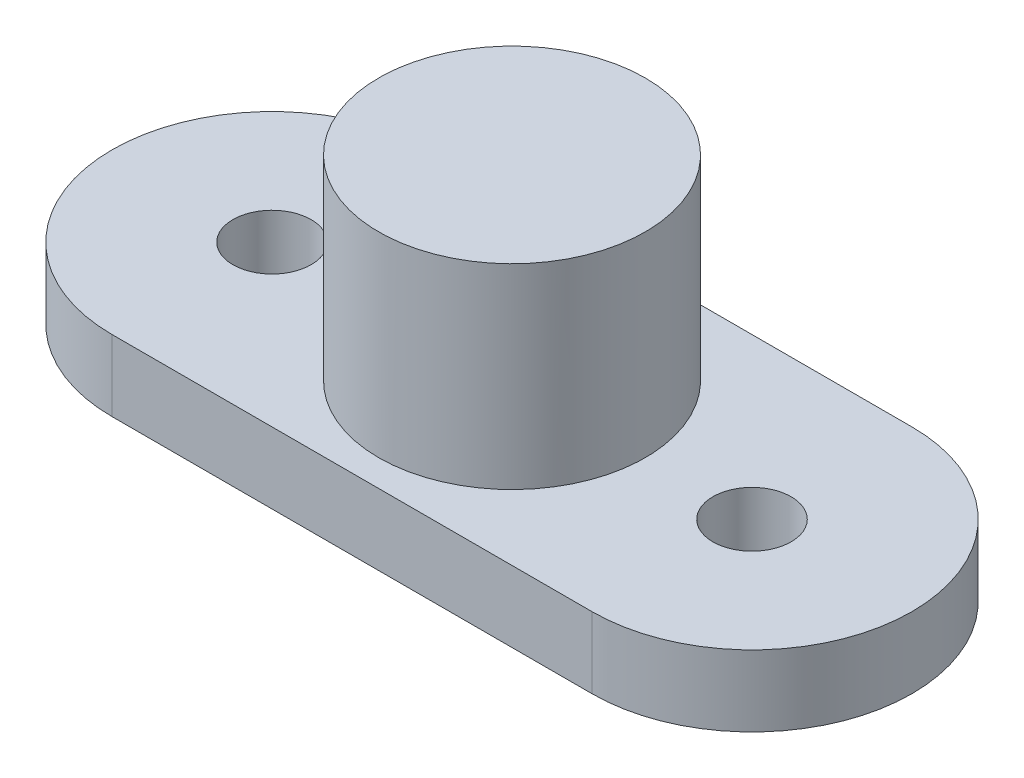
ISO-10303-21;
HEADER;
FILE_DESCRIPTION(('STEP AP214'),'2;1');
FILE_NAME('part.step','',(''),(''),'','','');
FILE_SCHEMA(('AUTOMOTIVE_DESIGN { 1 0 10303 214 1 1 1 1 }'));
ENDSEC;
DATA;
#1=APPLICATION_CONTEXT('core data for automotive mechanical design processes');
#2=APPLICATION_PROTOCOL_DEFINITION('international standard','automotive_design',2000,#1);
#3=PRODUCT_CONTEXT('',#1,'mechanical');
#4=PRODUCT('Part','Part','',(#3));
#5=PRODUCT_RELATED_PRODUCT_CATEGORY('part','',(#4));
#6=PRODUCT_DEFINITION_FORMATION('','',#4);
#7=PRODUCT_DEFINITION_CONTEXT('part definition',#1,'design');
#8=PRODUCT_DEFINITION('design','',#6,#7);
#9=PRODUCT_DEFINITION_SHAPE('','',#8);
#10=(LENGTH_UNIT() NAMED_UNIT(*) SI_UNIT(.MILLI.,.METRE.));
#11=(NAMED_UNIT(*) PLANE_ANGLE_UNIT() SI_UNIT($,.RADIAN.));
#12=(NAMED_UNIT(*) SI_UNIT($,.STERADIAN.) SOLID_ANGLE_UNIT());
#13=UNCERTAINTY_MEASURE_WITH_UNIT(LENGTH_MEASURE(1.E-05),#10,'distance_accuracy_value','');
#14=(GEOMETRIC_REPRESENTATION_CONTEXT(3) GLOBAL_UNCERTAINTY_ASSIGNED_CONTEXT((#13)) GLOBAL_UNIT_ASSIGNED_CONTEXT((#10,
#11,#12)) REPRESENTATION_CONTEXT('',''));
#15=CARTESIAN_POINT('',(0.,0.,0.));
#16=DIRECTION('',(0.,0.,1.));
#17=DIRECTION('',(1.,0.,0.));
#18=AXIS2_PLACEMENT_3D('',#15,#16,#17);
#19=CARTESIAN_POINT('',(0.,2.,-4.49950296687665));
#20=DIRECTION('',(0.,0.,-1.));
#21=DIRECTION('',(-1.,0.,0.));
#22=AXIS2_PLACEMENT_3D('',#19,#20,#21);
#23=PLANE('',#22);
#24=DIRECTION('',(1.,0.,0.));
#25=VECTOR('',#24,1.);
#26=CARTESIAN_POINT('',(0.,0.,-4.49950296687665));
#27=LINE('',#26,#25);
#28=CARTESIAN_POINT('',(-6.75,0.,-4.49950296687665));
#29=VERTEX_POINT('',#28);
#30=CARTESIAN_POINT('',(6.75,0.,-4.49950296687665));
#31=VERTEX_POINT('',#30);
#32=EDGE_CURVE('E119',#29,#31,#27,.T.);
#33=ORIENTED_EDGE('',*,*,#32,.F.);
#34=DIRECTION('',(0.,-1.,0.));
#35=VECTOR('',#34,1.);
#36=CARTESIAN_POINT('',(-6.75,2.,-4.49950296687665));
#37=LINE('',#36,#35);
#38=CARTESIAN_POINT('',(-6.75,2.,-4.49950296687665));
#39=VERTEX_POINT('',#38);
#40=EDGE_CURVE('E11',#39,#29,#37,.T.);
#41=ORIENTED_EDGE('',*,*,#40,.F.);
#42=DIRECTION('',(1.,0.,0.));
#43=VECTOR('',#42,1.);
#44=CARTESIAN_POINT('',(0.,2.,-4.49950296687665));
#45=LINE('',#44,#43);
#46=CARTESIAN_POINT('',(6.75,2.,-4.49950296687665));
#47=VERTEX_POINT('',#46);
#48=EDGE_CURVE('E96',#39,#47,#45,.T.);
#49=ORIENTED_EDGE('',*,*,#48,.T.);
#50=DIRECTION('',(0.,-1.,0.));
#51=VECTOR('',#50,1.);
#52=CARTESIAN_POINT('',(6.75,2.,-4.49950296687665));
#53=LINE('',#52,#51);
#54=EDGE_CURVE('E57',#47,#31,#53,.T.);
#55=ORIENTED_EDGE('',*,*,#54,.T.);
#56=EDGE_LOOP('',(#33,#41,#49,#55));
#57=FACE_BOUND('',#56,.T.);
#58=ADVANCED_FACE('F39',(#57),#23,.T.);
#59=CARTESIAN_POINT('',(-6.75,2.,0.));
#60=DIRECTION('',(0.,-1.,0.));
#61=DIRECTION('',(0.,0.,-1.));
#62=AXIS2_PLACEMENT_3D('',#59,#60,#61);
#63=CYLINDRICAL_SURFACE('',#62,4.49950296687665);
#64=CARTESIAN_POINT('',(-6.75,0.,0.));
#65=DIRECTION('',(0.,1.,0.));
#66=DIRECTION('',(0.,0.,1.));
#67=AXIS2_PLACEMENT_3D('',#64,#65,#66);
#68=CIRCLE('',#67,4.49950296687665);
#69=CARTESIAN_POINT('',(-6.75,0.,4.49950296687665));
#70=VERTEX_POINT('',#69);
#71=EDGE_CURVE('E102',#29,#70,#68,.T.);
#72=ORIENTED_EDGE('',*,*,#71,.T.);
#73=DIRECTION('',(0.,-1.,0.));
#74=VECTOR('',#73,1.);
#75=CARTESIAN_POINT('',(-6.75,2.,4.49950296687665));
#76=LINE('',#75,#74);
#77=CARTESIAN_POINT('',(-6.75,2.,4.49950296687665));
#78=VERTEX_POINT('',#77);
#79=EDGE_CURVE('E49',#78,#70,#76,.T.);
#80=ORIENTED_EDGE('',*,*,#79,.F.);
#81=CARTESIAN_POINT('',(-6.75,2.,0.));
#82=DIRECTION('',(0.,1.,0.));
#83=DIRECTION('',(0.,0.,1.));
#84=AXIS2_PLACEMENT_3D('',#81,#82,#83);
#85=CIRCLE('',#84,4.49950296687665);
#86=EDGE_CURVE('E92',#39,#78,#85,.T.);
#87=ORIENTED_EDGE('',*,*,#86,.F.);
#88=ORIENTED_EDGE('',*,*,#40,.T.);
#89=EDGE_LOOP('',(#72,#80,#87,#88));
#90=FACE_BOUND('',#89,.T.);
#91=ADVANCED_FACE('F100',(#90),#63,.T.);
#92=CARTESIAN_POINT('',(0.,2.,4.49950296687665));
#93=DIRECTION('',(0.,0.,-1.));
#94=DIRECTION('',(-1.,0.,0.));
#95=AXIS2_PLACEMENT_3D('',#92,#93,#94);
#96=PLANE('',#95);
#97=DIRECTION('',(1.,0.,0.));
#98=VECTOR('',#97,1.);
#99=CARTESIAN_POINT('',(0.,0.,4.49950296687665));
#100=LINE('',#99,#98);
#101=CARTESIAN_POINT('',(6.75,0.,4.49950296687665));
#102=VERTEX_POINT('',#101);
#103=EDGE_CURVE('E114',#70,#102,#100,.T.);
#104=ORIENTED_EDGE('',*,*,#103,.T.);
#105=DIRECTION('',(0.,-1.,0.));
#106=VECTOR('',#105,1.);
#107=CARTESIAN_POINT('',(6.75,2.,4.49950296687665));
#108=LINE('',#107,#106);
#109=CARTESIAN_POINT('',(6.75,2.,4.49950296687665));
#110=VERTEX_POINT('',#109);
#111=EDGE_CURVE('E71',#110,#102,#108,.T.);
#112=ORIENTED_EDGE('',*,*,#111,.F.);
#113=DIRECTION('',(1.,0.,0.));
#114=VECTOR('',#113,1.);
#115=CARTESIAN_POINT('',(0.,2.,4.49950296687665));
#116=LINE('',#115,#114);
#117=EDGE_CURVE('E83',#78,#110,#116,.T.);
#118=ORIENTED_EDGE('',*,*,#117,.F.);
#119=ORIENTED_EDGE('',*,*,#79,.T.);
#120=EDGE_LOOP('',(#104,#112,#118,#119));
#121=FACE_BOUND('',#120,.T.);
#122=ADVANCED_FACE('F85',(#121),#96,.F.);
#123=CARTESIAN_POINT('',(-6.75,2.,0.));
#124=DIRECTION('',(0.,-1.,0.));
#125=DIRECTION('',(0.,0.,-1.));
#126=AXIS2_PLACEMENT_3D('',#123,#124,#125);
#127=CYLINDRICAL_SURFACE('',#126,1.1);
#128=CARTESIAN_POINT('',(-6.75,2.,0.));
#129=DIRECTION('',(0.,1.,0.));
#130=DIRECTION('',(0.,0.,1.));
#131=AXIS2_PLACEMENT_3D('',#128,#129,#130);
#132=CIRCLE('',#131,1.1);
#133=CARTESIAN_POINT('',(-6.75,2.,1.1));
#134=VERTEX_POINT('',#133);
#135=EDGE_CURVE('E139',#134,#134,#132,.T.);
#136=ORIENTED_EDGE('',*,*,#135,.T.);
#137=EDGE_LOOP('',(#136));
#138=FACE_BOUND('',#137,.T.);
#139=CARTESIAN_POINT('',(-6.75,0.,0.));
#140=DIRECTION('',(0.,1.,0.));
#141=DIRECTION('',(0.,0.,1.));
#142=AXIS2_PLACEMENT_3D('',#139,#140,#141);
#143=CIRCLE('',#142,1.1);
#144=CARTESIAN_POINT('',(-6.75,0.,1.1));
#145=VERTEX_POINT('',#144);
#146=EDGE_CURVE('E122',#145,#145,#143,.T.);
#147=ORIENTED_EDGE('',*,*,#146,.F.);
#148=EDGE_LOOP('',(#147));
#149=FACE_BOUND('',#148,.T.);
#150=ADVANCED_FACE('F168',(#138,#149),#127,.F.);
#151=CARTESIAN_POINT('',(6.75,2.,0.));
#152=DIRECTION('',(0.,-1.,0.));
#153=DIRECTION('',(0.,0.,-1.));
#154=AXIS2_PLACEMENT_3D('',#151,#152,#153);
#155=CYLINDRICAL_SURFACE('',#154,1.1);
#156=CARTESIAN_POINT('',(6.75,2.,0.));
#157=DIRECTION('',(0.,1.,0.));
#158=DIRECTION('',(0.,0.,1.));
#159=AXIS2_PLACEMENT_3D('',#156,#157,#158);
#160=CIRCLE('',#159,1.1);
#161=CARTESIAN_POINT('',(6.75,2.,1.1));
#162=VERTEX_POINT('',#161);
#163=EDGE_CURVE('E113',#162,#162,#160,.T.);
#164=ORIENTED_EDGE('',*,*,#163,.T.);
#165=EDGE_LOOP('',(#164));
#166=FACE_BOUND('',#165,.T.);
#167=CARTESIAN_POINT('',(6.75,0.,0.));
#168=DIRECTION('',(0.,1.,0.));
#169=DIRECTION('',(0.,0.,1.));
#170=AXIS2_PLACEMENT_3D('',#167,#168,#169);
#171=CIRCLE('',#170,1.1);
#172=CARTESIAN_POINT('',(6.75,0.,1.1));
#173=VERTEX_POINT('',#172);
#174=EDGE_CURVE('E126',#173,#173,#171,.T.);
#175=ORIENTED_EDGE('',*,*,#174,.F.);
#176=EDGE_LOOP('',(#175));
#177=FACE_BOUND('',#176,.T.);
#178=ADVANCED_FACE('F41',(#166,#177),#155,.F.);
#179=CARTESIAN_POINT('',(6.75,2.,0.));
#180=DIRECTION('',(0.,-1.,0.));
#181=DIRECTION('',(0.,0.,-1.));
#182=AXIS2_PLACEMENT_3D('',#179,#180,#181);
#183=CYLINDRICAL_SURFACE('',#182,4.49950296687665);
#184=CARTESIAN_POINT('',(6.75,0.,0.));
#185=DIRECTION('',(0.,1.,0.));
#186=DIRECTION('',(0.,0.,1.));
#187=AXIS2_PLACEMENT_3D('',#184,#185,#186);
#188=CIRCLE('',#187,4.49950296687665);
#189=EDGE_CURVE('E109',#31,#102,#188,.F.);
#190=ORIENTED_EDGE('',*,*,#189,.F.);
#191=ORIENTED_EDGE('',*,*,#54,.F.);
#192=CARTESIAN_POINT('',(6.75,2.,0.));
#193=DIRECTION('',(0.,1.,0.));
#194=DIRECTION('',(0.,0.,1.));
#195=AXIS2_PLACEMENT_3D('',#192,#193,#194);
#196=CIRCLE('',#195,4.49950296687665);
#197=EDGE_CURVE('E91',#47,#110,#196,.F.);
#198=ORIENTED_EDGE('',*,*,#197,.T.);
#199=ORIENTED_EDGE('',*,*,#111,.T.);
#200=EDGE_LOOP('',(#190,#191,#198,#199));
#201=FACE_BOUND('',#200,.T.);
#202=ADVANCED_FACE('F175',(#201),#183,.T.);
#203=CARTESIAN_POINT('',(0.,2.,0.));
#204=DIRECTION('',(0.,1.,0.));
#205=DIRECTION('',(0.,0.,1.));
#206=AXIS2_PLACEMENT_3D('',#203,#204,#205);
#207=PLANE('',#206);
#208=ORIENTED_EDGE('',*,*,#163,.F.);
#209=EDGE_LOOP('',(#208));
#210=FACE_BOUND('',#209,.T.);
#211=ORIENTED_EDGE('',*,*,#135,.F.);
#212=EDGE_LOOP('',(#211));
#213=FACE_BOUND('',#212,.T.);
#214=CARTESIAN_POINT('',(0.,2.,0.));
#215=DIRECTION('',(0.,1.,0.));
#216=DIRECTION('',(0.,0.,1.));
#217=AXIS2_PLACEMENT_3D('',#214,#215,#216);
#218=CIRCLE('',#217,3.75);
#219=CARTESIAN_POINT('',(0.,2.,3.75));
#220=VERTEX_POINT('',#219);
#221=EDGE_CURVE('E135',#220,#220,#218,.T.);
#222=ORIENTED_EDGE('',*,*,#221,.F.);
#223=EDGE_LOOP('',(#222));
#224=FACE_BOUND('',#223,.T.);
#225=ORIENTED_EDGE('',*,*,#48,.F.);
#226=ORIENTED_EDGE('',*,*,#86,.T.);
#227=ORIENTED_EDGE('',*,*,#117,.T.);
#228=ORIENTED_EDGE('',*,*,#197,.F.);
#229=EDGE_LOOP('',(#225,#226,#227,#228));
#230=FACE_BOUND('',#229,.T.);
#231=ADVANCED_FACE('F95',(#210,#213,#224,#230),#207,.T.);
#232=CARTESIAN_POINT('',(0.,0.,0.));
#233=DIRECTION('',(0.,1.,0.));
#234=DIRECTION('',(0.,0.,1.));
#235=AXIS2_PLACEMENT_3D('',#232,#233,#234);
#236=PLANE('',#235);
#237=ORIENTED_EDGE('',*,*,#174,.T.);
#238=EDGE_LOOP('',(#237));
#239=FACE_BOUND('',#238,.T.);
#240=ORIENTED_EDGE('',*,*,#146,.T.);
#241=EDGE_LOOP('',(#240));
#242=FACE_BOUND('',#241,.T.);
#243=ORIENTED_EDGE('',*,*,#32,.T.);
#244=ORIENTED_EDGE('',*,*,#189,.T.);
#245=ORIENTED_EDGE('',*,*,#103,.F.);
#246=ORIENTED_EDGE('',*,*,#71,.F.);
#247=EDGE_LOOP('',(#243,#244,#245,#246));
#248=FACE_BOUND('',#247,.T.);
#249=ADVANCED_FACE('F158',(#239,#242,#248),#236,.F.);
#250=CARTESIAN_POINT('',(0.,7.5,0.));
#251=DIRECTION('',(0.,-1.,0.));
#252=DIRECTION('',(0.,0.,-1.));
#253=AXIS2_PLACEMENT_3D('',#250,#251,#252);
#254=CYLINDRICAL_SURFACE('',#253,3.75);
#255=ORIENTED_EDGE('',*,*,#221,.T.);
#256=EDGE_LOOP('',(#255));
#257=FACE_BOUND('',#256,.T.);
#258=CARTESIAN_POINT('',(0.,7.5,0.));
#259=DIRECTION('',(0.,-1.,0.));
#260=DIRECTION('',(0.,0.,-1.));
#261=AXIS2_PLACEMENT_3D('',#258,#259,#260);
#262=CIRCLE('',#261,3.75);
#263=CARTESIAN_POINT('',(0.,7.5,-3.75));
#264=VERTEX_POINT('',#263);
#265=EDGE_CURVE('E130',#264,#264,#262,.T.);
#266=ORIENTED_EDGE('',*,*,#265,.T.);
#267=EDGE_LOOP('',(#266));
#268=FACE_BOUND('',#267,.T.);
#269=ADVANCED_FACE('F150',(#257,#268),#254,.T.);
#270=CARTESIAN_POINT('',(0.,7.5,0.));
#271=DIRECTION('',(0.,-1.,0.));
#272=DIRECTION('',(0.,0.,-1.));
#273=AXIS2_PLACEMENT_3D('',#270,#271,#272);
#274=PLANE('',#273);
#275=ORIENTED_EDGE('',*,*,#265,.F.);
#276=EDGE_LOOP('',(#275));
#277=FACE_BOUND('',#276,.T.);
#278=ADVANCED_FACE('F152',(#277),#274,.F.);
#279=CLOSED_SHELL('',(#58,#91,#122,#150,#178,#202,#231,#249,#269,#278));
#280=MANIFOLD_SOLID_BREP('B2',#279);
#281=ADVANCED_BREP_SHAPE_REPRESENTATION('',(#18,#280),#14);
#282=SHAPE_DEFINITION_REPRESENTATION(#9,#281);
ENDSEC;
END-ISO-10303-21;
